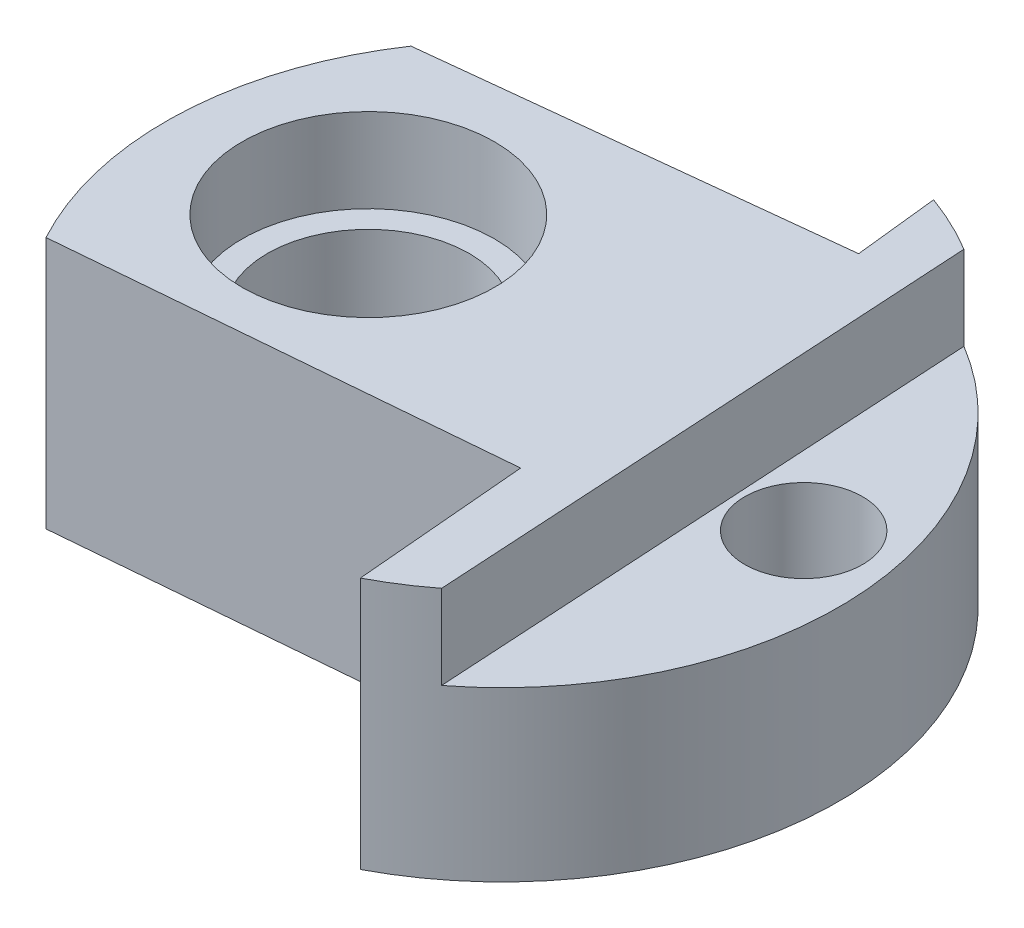
ISO-10303-21;
HEADER;
FILE_DESCRIPTION(('STEP AP214'),'2;1');
FILE_NAME('part.step','',(''),(''),'','','');
FILE_SCHEMA(('AUTOMOTIVE_DESIGN { 1 0 10303 214 1 1 1 1 }'));
ENDSEC;
DATA;
#1=APPLICATION_CONTEXT('core data for automotive mechanical design processes');
#2=APPLICATION_PROTOCOL_DEFINITION('international standard','automotive_design',2000,#1);
#3=PRODUCT_CONTEXT('',#1,'mechanical');
#4=PRODUCT('Part','Part','',(#3));
#5=PRODUCT_RELATED_PRODUCT_CATEGORY('part','',(#4));
#6=PRODUCT_DEFINITION_FORMATION('','',#4);
#7=PRODUCT_DEFINITION_CONTEXT('part definition',#1,'design');
#8=PRODUCT_DEFINITION('design','',#6,#7);
#9=PRODUCT_DEFINITION_SHAPE('','',#8);
#10=(LENGTH_UNIT() NAMED_UNIT(*) SI_UNIT(.MILLI.,.METRE.));
#11=(NAMED_UNIT(*) PLANE_ANGLE_UNIT() SI_UNIT($,.RADIAN.));
#12=(NAMED_UNIT(*) SI_UNIT($,.STERADIAN.) SOLID_ANGLE_UNIT());
#13=UNCERTAINTY_MEASURE_WITH_UNIT(LENGTH_MEASURE(1.E-05),#10,'distance_accuracy_value','');
#14=(GEOMETRIC_REPRESENTATION_CONTEXT(3) GLOBAL_UNCERTAINTY_ASSIGNED_CONTEXT((#13)) GLOBAL_UNIT_ASSIGNED_CONTEXT((#10,
#11,#12)) REPRESENTATION_CONTEXT('',''));
#15=CARTESIAN_POINT('',(0.,0.,0.));
#16=DIRECTION('',(0.,0.,1.));
#17=DIRECTION('',(1.,0.,0.));
#18=AXIS2_PLACEMENT_3D('',#15,#16,#17);
#19=CARTESIAN_POINT('',(0.,15.,0.));
#20=DIRECTION('',(0.,-1.,0.));
#21=DIRECTION('',(0.,0.,-1.));
#22=AXIS2_PLACEMENT_3D('',#19,#20,#21);
#23=CYLINDRICAL_SURFACE('',#22,20.);
#24=DIRECTION('',(0.,-1.,0.));
#25=VECTOR('',#24,1.);
#26=CARTESIAN_POINT('',(-16.591552302399,104.982357300444,-11.1678284458868));
#27=LINE('',#26,#25);
#28=CARTESIAN_POINT('',(-16.591552302399,15.,-11.1678284458869));
#29=VERTEX_POINT('',#28);
#30=CARTESIAN_POINT('',(-16.591552302399,0.,-11.1678284458869));
#31=VERTEX_POINT('',#30);
#32=EDGE_CURVE('E113',#29,#31,#27,.T.);
#33=ORIENTED_EDGE('',*,*,#32,.T.);
#34=CARTESIAN_POINT('',(0.,0.,0.));
#35=DIRECTION('',(0.,1.,0.));
#36=DIRECTION('',(0.,0.,1.));
#37=AXIS2_PLACEMENT_3D('',#34,#35,#36);
#38=CIRCLE('',#37,20.);
#39=CARTESIAN_POINT('',(-17.5846791986476,0.,9.52780444177204));
#40=VERTEX_POINT('',#39);
#41=EDGE_CURVE('E100',#31,#40,#38,.T.);
#42=ORIENTED_EDGE('',*,*,#41,.T.);
#43=DIRECTION('',(0.,-1.,0.));
#44=VECTOR('',#43,1.);
#45=CARTESIAN_POINT('',(-17.5846791986476,106.904374441998,9.52780444177204));
#46=LINE('',#45,#44);
#47=CARTESIAN_POINT('',(-17.5846791986476,15.,9.52780444177204));
#48=VERTEX_POINT('',#47);
#49=EDGE_CURVE('E123',#48,#40,#46,.T.);
#50=ORIENTED_EDGE('',*,*,#49,.F.);
#51=CARTESIAN_POINT('',(0.,15.,0.));
#52=DIRECTION('',(0.,1.,0.));
#53=DIRECTION('',(0.,0.,1.));
#54=AXIS2_PLACEMENT_3D('',#51,#52,#53);
#55=CIRCLE('',#54,20.);
#56=EDGE_CURVE('E164',#29,#48,#55,.T.);
#57=ORIENTED_EDGE('',*,*,#56,.F.);
#58=EDGE_LOOP('',(#33,#42,#50,#57));
#59=FACE_BOUND('',#58,.T.);
#60=ADVANCED_FACE('F33',(#59),#23,.T.);
#61=DIRECTION('',(0.,-1.,0.));
#62=VECTOR('',#61,1.);
#63=CARTESIAN_POINT('',(6.8496580316548,104.982357300444,-18.7904812298511));
#64=LINE('',#63,#62);
#65=CARTESIAN_POINT('',(6.8496580316548,15.,-18.7904812298511));
#66=VERTEX_POINT('',#65);
#67=CARTESIAN_POINT('',(6.8496580316548,0.,-18.7904812298511));
#68=VERTEX_POINT('',#67);
#69=EDGE_CURVE('E109',#66,#68,#64,.T.);
#70=ORIENTED_EDGE('',*,*,#69,.F.);
#71=CARTESIAN_POINT('',(10.2938365998695,15.,-17.1475050096271));
#72=VERTEX_POINT('',#71);
#73=EDGE_CURVE('E161',#72,#66,#55,.T.);
#74=ORIENTED_EDGE('',*,*,#73,.F.);
#75=DIRECTION('',(0.,-1.,0.));
#76=VECTOR('',#75,1.);
#77=CARTESIAN_POINT('',(10.2938365998695,88.1543744419977,-17.1475050096271));
#78=LINE('',#77,#76);
#79=CARTESIAN_POINT('',(10.2938365998695,10.,-17.1475050096271));
#80=VERTEX_POINT('',#79);
#81=EDGE_CURVE('E154',#72,#80,#78,.T.);
#82=ORIENTED_EDGE('',*,*,#81,.T.);
#83=CARTESIAN_POINT('',(0.,10.,0.));
#84=DIRECTION('',(0.,1.,0.));
#85=DIRECTION('',(0.,0.,1.));
#86=AXIS2_PLACEMENT_3D('',#83,#84,#85);
#87=CIRCLE('',#86,20.);
#88=CARTESIAN_POINT('',(12.2251512582809,10.,15.8286347077741));
#89=VERTEX_POINT('',#88);
#90=EDGE_CURVE('E146',#89,#80,#87,.T.);
#91=ORIENTED_EDGE('',*,*,#90,.F.);
#92=DIRECTION('',(0.,-1.,0.));
#93=VECTOR('',#92,1.);
#94=CARTESIAN_POINT('',(12.2251512582809,88.1543744419977,15.8286347077741));
#95=LINE('',#94,#93);
#96=CARTESIAN_POINT('',(12.2251512582809,15.,15.8286347077741));
#97=VERTEX_POINT('',#96);
#98=EDGE_CURVE('E151',#97,#89,#95,.T.);
#99=ORIENTED_EDGE('',*,*,#98,.F.);
#100=CARTESIAN_POINT('',(9.28401232818413,15.,17.7146017479966));
#101=VERTEX_POINT('',#100);
#102=EDGE_CURVE('E165',#101,#97,#55,.T.);
#103=ORIENTED_EDGE('',*,*,#102,.F.);
#104=DIRECTION('',(0.,-1.,0.));
#105=VECTOR('',#104,1.);
#106=CARTESIAN_POINT('',(9.28401232818413,106.904374441998,17.7146017479966));
#107=LINE('',#106,#105);
#108=CARTESIAN_POINT('',(9.28401232818413,0.,17.7146017479966));
#109=VERTEX_POINT('',#108);
#110=EDGE_CURVE('E120',#101,#109,#107,.T.);
#111=ORIENTED_EDGE('',*,*,#110,.T.);
#112=EDGE_CURVE('E166',#109,#68,#38,.T.);
#113=ORIENTED_EDGE('',*,*,#112,.T.);
#114=EDGE_LOOP('',(#70,#74,#82,#91,#99,#103,#111,#113));
#115=FACE_BOUND('',#114,.T.);
#116=ADVANCED_FACE('F190',(#115),#23,.T.);
#117=CARTESIAN_POINT('',(0.,15.,0.));
#118=DIRECTION('',(0.,1.,0.));
#119=DIRECTION('',(0.,0.,1.));
#120=AXIS2_PLACEMENT_3D('',#117,#118,#119);
#121=PLANE('',#120);
#122=CARTESIAN_POINT('',(-9.1882924506308,15.,-1.23012627901176));
#123=DIRECTION('',(0.,1.,0.));
#124=DIRECTION('',(0.,0.,1.));
#125=AXIS2_PLACEMENT_3D('',#122,#123,#124);
#126=CIRCLE('',#125,7.5);
#127=CARTESIAN_POINT('',(-9.1882924506308,15.,6.26987372098824));
#128=VERTEX_POINT('',#127);
#129=EDGE_CURVE('E140',#128,#128,#126,.T.);
#130=ORIENTED_EDGE('',*,*,#129,.F.);
#131=EDGE_LOOP('',(#130));
#132=FACE_BOUND('',#131,.T.);
#133=DIRECTION('',(0.108539544563323,0.,0.994092132181915));
#134=VECTOR('',#133,1.);
#135=CARTESIAN_POINT('',(8.79642447379517,15.,-0.960434023429814));
#136=LINE('',#135,#134);
#137=CARTESIAN_POINT('',(7.39597238600709,15.,-13.7868965589867));
#138=VERTEX_POINT('',#137);
#139=EDGE_CURVE('E47',#66,#138,#136,.T.);
#140=ORIENTED_EDGE('',*,*,#139,.T.);
#141=DIRECTION('',(-0.994092132181915,0.,0.108539544563324));
#142=VECTOR('',#141,1.);
#143=CARTESIAN_POINT('',(-1.40045208778809,15.,-12.8264625355569));
#144=LINE('',#143,#142);
#145=EDGE_CURVE('E51',#138,#29,#144,.T.);
#146=ORIENTED_EDGE('',*,*,#145,.T.);
#147=ORIENTED_EDGE('',*,*,#56,.T.);
#148=DIRECTION('',(-0.996302586604377,0.,0.0859136538940584));
#149=VECTOR('',#148,1.);
#150=CARTESIAN_POINT('',(0.685746648004905,15.,7.95230010825809));
#151=LINE('',#150,#149);
#152=CARTESIAN_POINT('',(8.38493326031653,15.,7.28838006752996));
#153=VERTEX_POINT('',#152);
#154=EDGE_CURVE('E129',#153,#48,#151,.T.);
#155=ORIENTED_EDGE('',*,*,#154,.F.);
#156=DIRECTION('',(-0.0859136538940583,0.,-0.996302586604377));
#157=VECTOR('',#156,1.);
#158=CARTESIAN_POINT('',(7.69918661231163,15.,-0.663920040728119));
#159=LINE('',#158,#157);
#160=EDGE_CURVE('E127',#101,#153,#159,.T.);
#161=ORIENTED_EDGE('',*,*,#160,.F.);
#162=ORIENTED_EDGE('',*,*,#102,.T.);
#163=DIRECTION('',(0.0584668452143223,0.,0.998289350845077));
#164=VECTOR('',#163,1.);
#165=CARTESIAN_POINT('',(10.2938365998695,15.,-17.1475050096271));
#166=LINE('',#165,#164);
#167=EDGE_CURVE('E157',#72,#97,#166,.T.);
#168=ORIENTED_EDGE('',*,*,#167,.F.);
#169=ORIENTED_EDGE('',*,*,#73,.T.);
#170=EDGE_LOOP('',(#140,#146,#147,#155,#161,#162,#168,#169));
#171=FACE_BOUND('',#170,.T.);
#172=ADVANCED_FACE('F182',(#132,#171),#121,.T.);
#173=CARTESIAN_POINT('',(0.,0.,0.));
#174=DIRECTION('',(0.,1.,0.));
#175=DIRECTION('',(0.,0.,1.));
#176=AXIS2_PLACEMENT_3D('',#173,#174,#175);
#177=PLANE('',#176);
#178=CARTESIAN_POINT('',(15.0142611765247,0.,-2.90269014794831));
#179=DIRECTION('',(0.,1.,0.));
#180=DIRECTION('',(0.,0.,1.));
#181=AXIS2_PLACEMENT_3D('',#178,#179,#180);
#182=CIRCLE('',#181,3.5);
#183=CARTESIAN_POINT('',(15.0142611765247,0.,0.597309852051694));
#184=VERTEX_POINT('',#183);
#185=EDGE_CURVE('E143',#184,#184,#182,.T.);
#186=ORIENTED_EDGE('',*,*,#185,.T.);
#187=EDGE_LOOP('',(#186));
#188=FACE_BOUND('',#187,.T.);
#189=CARTESIAN_POINT('',(-9.1882924506308,0.,-1.23012627901176));
#190=DIRECTION('',(0.,1.,0.));
#191=DIRECTION('',(0.,0.,1.));
#192=AXIS2_PLACEMENT_3D('',#189,#190,#191);
#193=CIRCLE('',#192,6.);
#194=CARTESIAN_POINT('',(-9.1882924506308,0.,4.76987372098824));
#195=VERTEX_POINT('',#194);
#196=EDGE_CURVE('E132',#195,#195,#193,.T.);
#197=ORIENTED_EDGE('',*,*,#196,.T.);
#198=EDGE_LOOP('',(#197));
#199=FACE_BOUND('',#198,.T.);
#200=DIRECTION('',(-0.994092132181915,0.,0.108539544563324));
#201=VECTOR('',#200,1.);
#202=CARTESIAN_POINT('',(-1.40045208778809,0.,-12.8264625355569));
#203=LINE('',#202,#201);
#204=CARTESIAN_POINT('',(7.39597238600709,0.,-13.7868965589867));
#205=VERTEX_POINT('',#204);
#206=EDGE_CURVE('E11',#205,#31,#203,.T.);
#207=ORIENTED_EDGE('',*,*,#206,.F.);
#208=DIRECTION('',(0.108539544563323,0.,0.994092132181915));
#209=VECTOR('',#208,1.);
#210=CARTESIAN_POINT('',(8.79642447379517,0.,-0.960434023429814));
#211=LINE('',#210,#209);
#212=EDGE_CURVE('E40',#68,#205,#211,.T.);
#213=ORIENTED_EDGE('',*,*,#212,.F.);
#214=ORIENTED_EDGE('',*,*,#112,.F.);
#215=DIRECTION('',(-0.0859136538940583,0.,-0.996302586604377));
#216=VECTOR('',#215,1.);
#217=CARTESIAN_POINT('',(7.69918661231163,0.,-0.663920040728119));
#218=LINE('',#217,#216);
#219=CARTESIAN_POINT('',(8.38493326031653,0.,7.28838006752996));
#220=VERTEX_POINT('',#219);
#221=EDGE_CURVE('E163',#109,#220,#218,.T.);
#222=ORIENTED_EDGE('',*,*,#221,.T.);
#223=DIRECTION('',(-0.996302586604377,0.,0.0859136538940584));
#224=VECTOR('',#223,1.);
#225=CARTESIAN_POINT('',(0.685746648004905,0.,7.95230010825809));
#226=LINE('',#225,#224);
#227=EDGE_CURVE('E110',#220,#40,#226,.T.);
#228=ORIENTED_EDGE('',*,*,#227,.T.);
#229=ORIENTED_EDGE('',*,*,#41,.F.);
#230=EDGE_LOOP('',(#207,#213,#214,#222,#228,#229));
#231=FACE_BOUND('',#230,.T.);
#232=ADVANCED_FACE('F96',(#188,#199,#231),#177,.F.);
#233=CARTESIAN_POINT('',(10.2938365998695,88.1543744419977,-17.1475050096271));
#234=DIRECTION('',(0.998289350845077,0.,-0.0584668452143223));
#235=DIRECTION('',(-0.0584668452143223,0.,-0.998289350845077));
#236=AXIS2_PLACEMENT_3D('',#233,#234,#235);
#237=PLANE('',#236);
#238=ORIENTED_EDGE('',*,*,#81,.F.);
#239=ORIENTED_EDGE('',*,*,#167,.T.);
#240=ORIENTED_EDGE('',*,*,#98,.T.);
#241=DIRECTION('',(0.0584668452143223,0.,0.998289350845077));
#242=VECTOR('',#241,1.);
#243=CARTESIAN_POINT('',(10.2938365998695,9.99999999999999,-17.1475050096271));
#244=LINE('',#243,#242);
#245=EDGE_CURVE('E149',#80,#89,#244,.T.);
#246=ORIENTED_EDGE('',*,*,#245,.F.);
#247=EDGE_LOOP('',(#238,#239,#240,#246));
#248=FACE_BOUND('',#247,.T.);
#249=ADVANCED_FACE('F187',(#248),#237,.T.);
#250=CARTESIAN_POINT('',(0.,10.,0.));
#251=DIRECTION('',(0.,1.,0.));
#252=DIRECTION('',(0.,0.,1.));
#253=AXIS2_PLACEMENT_3D('',#250,#251,#252);
#254=PLANE('',#253);
#255=CARTESIAN_POINT('',(15.0142611765247,10.,-2.90269014794831));
#256=DIRECTION('',(0.,1.,0.));
#257=DIRECTION('',(0.,0.,1.));
#258=AXIS2_PLACEMENT_3D('',#255,#256,#257);
#259=CIRCLE('',#258,3.5);
#260=CARTESIAN_POINT('',(15.0142611765247,10.,0.597309852051694));
#261=VERTEX_POINT('',#260);
#262=EDGE_CURVE('E139',#261,#261,#259,.T.);
#263=ORIENTED_EDGE('',*,*,#262,.F.);
#264=EDGE_LOOP('',(#263));
#265=FACE_BOUND('',#264,.T.);
#266=ORIENTED_EDGE('',*,*,#245,.T.);
#267=ORIENTED_EDGE('',*,*,#90,.T.);
#268=EDGE_LOOP('',(#266,#267));
#269=FACE_BOUND('',#268,.T.);
#270=ADVANCED_FACE('F192',(#265,#269),#254,.T.);
#271=CARTESIAN_POINT('',(15.0142611765247,0.,-2.90269014794831));
#272=DIRECTION('',(0.,1.,0.));
#273=DIRECTION('',(0.,0.,1.));
#274=AXIS2_PLACEMENT_3D('',#271,#272,#273);
#275=CYLINDRICAL_SURFACE('',#274,3.5);
#276=ORIENTED_EDGE('',*,*,#185,.F.);
#277=EDGE_LOOP('',(#276));
#278=FACE_BOUND('',#277,.T.);
#279=ORIENTED_EDGE('',*,*,#262,.T.);
#280=EDGE_LOOP('',(#279));
#281=FACE_BOUND('',#280,.T.);
#282=ADVANCED_FACE('F194',(#278,#281),#275,.F.);
#283=CARTESIAN_POINT('',(-9.1882924506308,10.,-1.23012627901176));
#284=DIRECTION('',(0.,1.,0.));
#285=DIRECTION('',(0.,0.,1.));
#286=AXIS2_PLACEMENT_3D('',#283,#284,#285);
#287=CYLINDRICAL_SURFACE('',#286,7.5);
#288=CARTESIAN_POINT('',(-9.1882924506308,10.,-1.23012627901176));
#289=DIRECTION('',(0.,1.,0.));
#290=DIRECTION('',(0.,0.,1.));
#291=AXIS2_PLACEMENT_3D('',#288,#289,#290);
#292=CIRCLE('',#291,7.5);
#293=CARTESIAN_POINT('',(-9.1882924506308,10.,6.26987372098824));
#294=VERTEX_POINT('',#293);
#295=EDGE_CURVE('E136',#294,#294,#292,.T.);
#296=ORIENTED_EDGE('',*,*,#295,.F.);
#297=EDGE_LOOP('',(#296));
#298=FACE_BOUND('',#297,.T.);
#299=ORIENTED_EDGE('',*,*,#129,.T.);
#300=EDGE_LOOP('',(#299));
#301=FACE_BOUND('',#300,.T.);
#302=ADVANCED_FACE('F201',(#298,#301),#287,.F.);
#303=CARTESIAN_POINT('',(-9.1882924506308,10.,-1.23012627901176));
#304=DIRECTION('',(0.,1.,0.));
#305=DIRECTION('',(0.,0.,1.));
#306=AXIS2_PLACEMENT_3D('',#303,#304,#305);
#307=PLANE('',#306);
#308=CARTESIAN_POINT('',(-9.1882924506308,10.,-1.23012627901176));
#309=DIRECTION('',(0.,1.,0.));
#310=DIRECTION('',(0.,0.,1.));
#311=AXIS2_PLACEMENT_3D('',#308,#309,#310);
#312=CIRCLE('',#311,6.);
#313=CARTESIAN_POINT('',(-9.1882924506308,10.,4.76987372098824));
#314=VERTEX_POINT('',#313);
#315=EDGE_CURVE('E135',#314,#314,#312,.T.);
#316=ORIENTED_EDGE('',*,*,#315,.F.);
#317=EDGE_LOOP('',(#316));
#318=FACE_BOUND('',#317,.T.);
#319=ORIENTED_EDGE('',*,*,#295,.T.);
#320=EDGE_LOOP('',(#319));
#321=FACE_BOUND('',#320,.T.);
#322=ADVANCED_FACE('F222',(#318,#321),#307,.T.);
#323=CARTESIAN_POINT('',(-9.1882924506308,0.,-1.23012627901176));
#324=DIRECTION('',(0.,1.,0.));
#325=DIRECTION('',(0.,0.,1.));
#326=AXIS2_PLACEMENT_3D('',#323,#324,#325);
#327=CYLINDRICAL_SURFACE('',#326,6.);
#328=ORIENTED_EDGE('',*,*,#315,.T.);
#329=EDGE_LOOP('',(#328));
#330=FACE_BOUND('',#329,.T.);
#331=ORIENTED_EDGE('',*,*,#196,.F.);
#332=EDGE_LOOP('',(#331));
#333=FACE_BOUND('',#332,.T.);
#334=ADVANCED_FACE('F228',(#330,#333),#327,.F.);
#335=CARTESIAN_POINT('',(-17.5846791986476,106.904374441998,9.52780444177204));
#336=DIRECTION('',(-0.0859136538940584,0.,-0.996302586604377));
#337=DIRECTION('',(-0.996302586604377,0.,0.0859136538940584));
#338=AXIS2_PLACEMENT_3D('',#335,#336,#337);
#339=PLANE('',#338);
#340=DIRECTION('',(0.,-1.,0.));
#341=VECTOR('',#340,1.);
#342=CARTESIAN_POINT('',(8.38493326031653,106.904374441998,7.28838006752996));
#343=LINE('',#342,#341);
#344=EDGE_CURVE('E119',#153,#220,#343,.T.);
#345=ORIENTED_EDGE('',*,*,#344,.F.);
#346=ORIENTED_EDGE('',*,*,#154,.T.);
#347=ORIENTED_EDGE('',*,*,#49,.T.);
#348=ORIENTED_EDGE('',*,*,#227,.F.);
#349=EDGE_LOOP('',(#345,#346,#347,#348));
#350=FACE_BOUND('',#349,.T.);
#351=ADVANCED_FACE('F175',(#350),#339,.F.);
#352=CARTESIAN_POINT('',(8.38493326031653,106.904374441998,7.28838006752996));
#353=DIRECTION('',(0.996302586604377,0.,-0.0859136538940583));
#354=DIRECTION('',(-0.0859136538940583,0.,-0.996302586604377));
#355=AXIS2_PLACEMENT_3D('',#352,#353,#354);
#356=PLANE('',#355);
#357=ORIENTED_EDGE('',*,*,#110,.F.);
#358=ORIENTED_EDGE('',*,*,#160,.T.);
#359=ORIENTED_EDGE('',*,*,#344,.T.);
#360=ORIENTED_EDGE('',*,*,#221,.F.);
#361=EDGE_LOOP('',(#357,#358,#359,#360));
#362=FACE_BOUND('',#361,.T.);
#363=ADVANCED_FACE('F238',(#362),#356,.F.);
#364=CARTESIAN_POINT('',(-16.591552302399,104.982357300444,-11.1678284458868));
#365=DIRECTION('',(-0.108539544563324,0.,-0.994092132181915));
#366=DIRECTION('',(-0.994092132181915,0.,0.108539544563324));
#367=AXIS2_PLACEMENT_3D('',#364,#365,#366);
#368=PLANE('',#367);
#369=ORIENTED_EDGE('',*,*,#145,.F.);
#370=DIRECTION('',(0.,-1.,0.));
#371=VECTOR('',#370,1.);
#372=CARTESIAN_POINT('',(7.39597238600709,104.982357300444,-13.7868965589867));
#373=LINE('',#372,#371);
#374=EDGE_CURVE('E108',#138,#205,#373,.T.);
#375=ORIENTED_EDGE('',*,*,#374,.T.);
#376=ORIENTED_EDGE('',*,*,#206,.T.);
#377=ORIENTED_EDGE('',*,*,#32,.F.);
#378=EDGE_LOOP('',(#369,#375,#376,#377));
#379=FACE_BOUND('',#378,.T.);
#380=ADVANCED_FACE('F111',(#379),#368,.T.);
#381=CARTESIAN_POINT('',(7.39597238600709,104.982357300444,-13.7868965589867));
#382=DIRECTION('',(-0.994092132181915,0.,0.108539544563323));
#383=DIRECTION('',(0.108539544563323,0.,0.994092132181915));
#384=AXIS2_PLACEMENT_3D('',#381,#382,#383);
#385=PLANE('',#384);
#386=ORIENTED_EDGE('',*,*,#139,.F.);
#387=ORIENTED_EDGE('',*,*,#69,.T.);
#388=ORIENTED_EDGE('',*,*,#212,.T.);
#389=ORIENTED_EDGE('',*,*,#374,.F.);
#390=EDGE_LOOP('',(#386,#387,#388,#389));
#391=FACE_BOUND('',#390,.T.);
#392=ADVANCED_FACE('F107',(#391),#385,.T.);
#393=CLOSED_SHELL('',(#60,#116,#172,#232,#249,#270,#282,#302,#322,#334,#351,#363,#380,#392));
#394=MANIFOLD_SOLID_BREP('B2',#393);
#395=ADVANCED_BREP_SHAPE_REPRESENTATION('',(#18,#394),#14);
#396=SHAPE_DEFINITION_REPRESENTATION(#9,#395);
ENDSEC;
END-ISO-10303-21;
